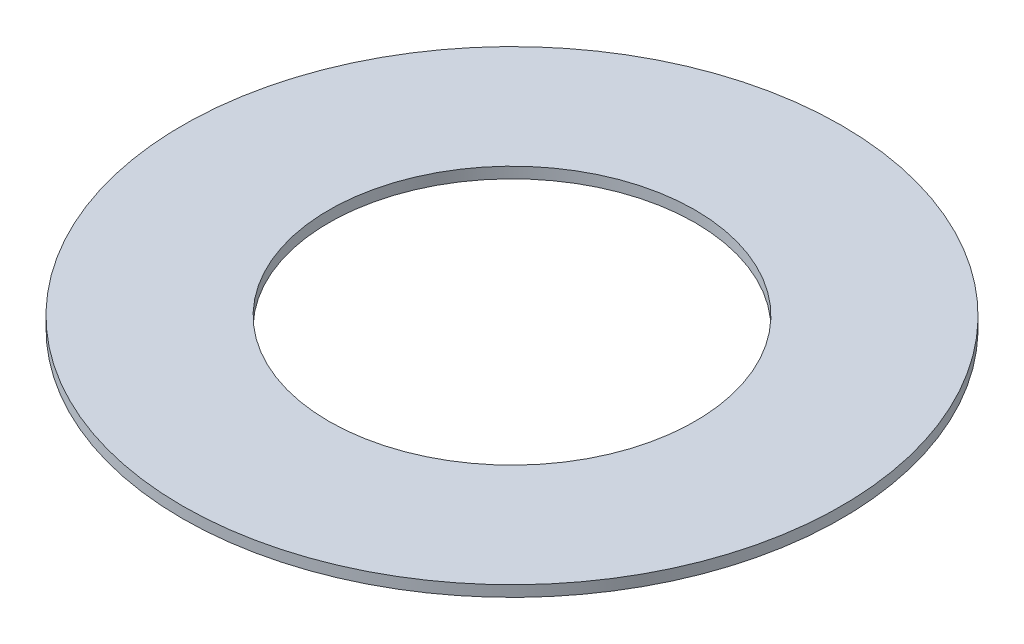
ISO-10303-21;
HEADER;
FILE_DESCRIPTION(('STEP AP214'),'2;1');
FILE_NAME('part.step','',(''),(''),'','','');
FILE_SCHEMA(('AUTOMOTIVE_DESIGN { 1 0 10303 214 1 1 1 1 }'));
ENDSEC;
DATA;
#1=APPLICATION_CONTEXT('core data for automotive mechanical design processes');
#2=APPLICATION_PROTOCOL_DEFINITION('international standard','automotive_design',2000,#1);
#3=PRODUCT_CONTEXT('',#1,'mechanical');
#4=PRODUCT('Part','Part','',(#3));
#5=PRODUCT_RELATED_PRODUCT_CATEGORY('part','',(#4));
#6=PRODUCT_DEFINITION_FORMATION('','',#4);
#7=PRODUCT_DEFINITION_CONTEXT('part definition',#1,'design');
#8=PRODUCT_DEFINITION('design','',#6,#7);
#9=PRODUCT_DEFINITION_SHAPE('','',#8);
#10=(LENGTH_UNIT() NAMED_UNIT(*) SI_UNIT(.MILLI.,.METRE.));
#11=(NAMED_UNIT(*) PLANE_ANGLE_UNIT() SI_UNIT($,.RADIAN.));
#12=(NAMED_UNIT(*) SI_UNIT($,.STERADIAN.) SOLID_ANGLE_UNIT());
#13=UNCERTAINTY_MEASURE_WITH_UNIT(LENGTH_MEASURE(1.E-05),#10,'distance_accuracy_value','');
#14=(GEOMETRIC_REPRESENTATION_CONTEXT(3) GLOBAL_UNCERTAINTY_ASSIGNED_CONTEXT((#13)) GLOBAL_UNIT_ASSIGNED_CONTEXT((#10,
#11,#12)) REPRESENTATION_CONTEXT('',''));
#15=CARTESIAN_POINT('',(0.,0.,0.));
#16=DIRECTION('',(0.,0.,1.));
#17=DIRECTION('',(1.,0.,0.));
#18=AXIS2_PLACEMENT_3D('',#15,#16,#17);
#19=CARTESIAN_POINT('',(0.,0.3,0.));
#20=DIRECTION('',(0.,1.,0.));
#21=DIRECTION('',(0.,0.,1.));
#22=AXIS2_PLACEMENT_3D('',#19,#20,#21);
#23=PLANE('',#22);
#24=CARTESIAN_POINT('',(0.,0.3,0.));
#25=DIRECTION('',(0.,1.,0.));
#26=DIRECTION('',(0.,0.,1.));
#27=AXIS2_PLACEMENT_3D('',#24,#25,#26);
#28=CIRCLE('',#27,9.);
#29=CARTESIAN_POINT('',(0.,0.3,9.));
#30=VERTEX_POINT('',#29);
#31=EDGE_CURVE('E10',#30,#30,#28,.T.);
#32=ORIENTED_EDGE('',*,*,#31,.T.);
#33=EDGE_LOOP('',(#32));
#34=FACE_BOUND('',#33,.T.);
#35=CARTESIAN_POINT('',(0.,0.3,0.));
#36=DIRECTION('',(0.,1.,0.));
#37=DIRECTION('',(0.,0.,1.));
#38=AXIS2_PLACEMENT_3D('',#35,#36,#37);
#39=CIRCLE('',#38,5.);
#40=CARTESIAN_POINT('',(0.,0.3,5.));
#41=VERTEX_POINT('',#40);
#42=EDGE_CURVE('E44',#41,#41,#39,.T.);
#43=ORIENTED_EDGE('',*,*,#42,.F.);
#44=EDGE_LOOP('',(#43));
#45=FACE_BOUND('',#44,.T.);
#46=ADVANCED_FACE('F33',(#34,#45),#23,.T.);
#47=CARTESIAN_POINT('',(0.,0.,0.));
#48=DIRECTION('',(0.,1.,0.));
#49=DIRECTION('',(0.,0.,1.));
#50=AXIS2_PLACEMENT_3D('',#47,#48,#49);
#51=PLANE('',#50);
#52=CARTESIAN_POINT('',(0.,0.,0.));
#53=DIRECTION('',(0.,1.,0.));
#54=DIRECTION('',(0.,0.,1.));
#55=AXIS2_PLACEMENT_3D('',#52,#53,#54);
#56=CIRCLE('',#55,9.);
#57=CARTESIAN_POINT('',(0.,0.,9.));
#58=VERTEX_POINT('',#57);
#59=EDGE_CURVE('E37',#58,#58,#56,.T.);
#60=ORIENTED_EDGE('',*,*,#59,.F.);
#61=EDGE_LOOP('',(#60));
#62=FACE_BOUND('',#61,.T.);
#63=CARTESIAN_POINT('',(0.,0.,0.));
#64=DIRECTION('',(0.,1.,0.));
#65=DIRECTION('',(0.,0.,1.));
#66=AXIS2_PLACEMENT_3D('',#63,#64,#65);
#67=CIRCLE('',#66,5.);
#68=CARTESIAN_POINT('',(0.,0.,5.));
#69=VERTEX_POINT('',#68);
#70=EDGE_CURVE('E46',#69,#69,#67,.T.);
#71=ORIENTED_EDGE('',*,*,#70,.T.);
#72=EDGE_LOOP('',(#71));
#73=FACE_BOUND('',#72,.T.);
#74=ADVANCED_FACE('F56',(#62,#73),#51,.F.);
#75=CARTESIAN_POINT('',(0.,0.3,0.));
#76=DIRECTION('',(0.,-1.,0.));
#77=DIRECTION('',(0.,0.,-1.));
#78=AXIS2_PLACEMENT_3D('',#75,#76,#77);
#79=CYLINDRICAL_SURFACE('',#78,9.);
#80=ORIENTED_EDGE('',*,*,#31,.F.);
#81=EDGE_LOOP('',(#80));
#82=FACE_BOUND('',#81,.T.);
#83=ORIENTED_EDGE('',*,*,#59,.T.);
#84=EDGE_LOOP('',(#83));
#85=FACE_BOUND('',#84,.T.);
#86=ADVANCED_FACE('F35',(#82,#85),#79,.T.);
#87=CARTESIAN_POINT('',(0.,0.3,0.));
#88=DIRECTION('',(0.,-1.,0.));
#89=DIRECTION('',(0.,0.,-1.));
#90=AXIS2_PLACEMENT_3D('',#87,#88,#89);
#91=CYLINDRICAL_SURFACE('',#90,5.);
#92=ORIENTED_EDGE('',*,*,#42,.T.);
#93=EDGE_LOOP('',(#92));
#94=FACE_BOUND('',#93,.T.);
#95=ORIENTED_EDGE('',*,*,#70,.F.);
#96=EDGE_LOOP('',(#95));
#97=FACE_BOUND('',#96,.T.);
#98=ADVANCED_FACE('F52',(#94,#97),#91,.F.);
#99=CLOSED_SHELL('',(#46,#74,#86,#98));
#100=MANIFOLD_SOLID_BREP('B2',#99);
#101=ADVANCED_BREP_SHAPE_REPRESENTATION('',(#18,#100),#14);
#102=SHAPE_DEFINITION_REPRESENTATION(#9,#101);
ENDSEC;
END-ISO-10303-21;
